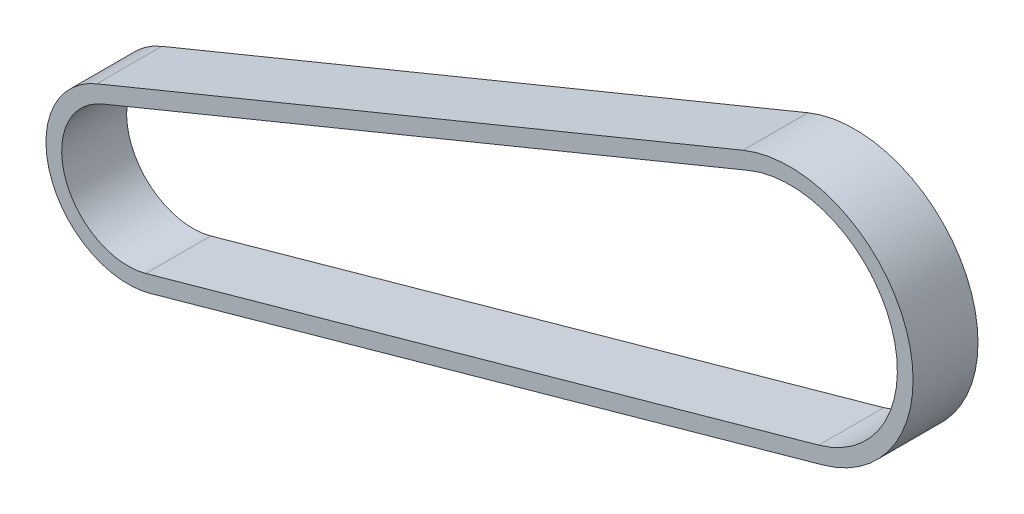
ISO-10303-21;
HEADER;
FILE_DESCRIPTION(('STEP AP214'),'2;1');
FILE_NAME('part.step','',(''),(''),'','','');
FILE_SCHEMA(('AUTOMOTIVE_DESIGN { 1 0 10303 214 1 1 1 1 }'));
ENDSEC;
DATA;
#1=APPLICATION_CONTEXT('core data for automotive mechanical design processes');
#2=APPLICATION_PROTOCOL_DEFINITION('international standard','automotive_design',2000,#1);
#3=PRODUCT_CONTEXT('',#1,'mechanical');
#4=PRODUCT('Part','Part','',(#3));
#5=PRODUCT_RELATED_PRODUCT_CATEGORY('part','',(#4));
#6=PRODUCT_DEFINITION_FORMATION('','',#4);
#7=PRODUCT_DEFINITION_CONTEXT('part definition',#1,'design');
#8=PRODUCT_DEFINITION('design','',#6,#7);
#9=PRODUCT_DEFINITION_SHAPE('','',#8);
#10=(LENGTH_UNIT() NAMED_UNIT(*) SI_UNIT(.MILLI.,.METRE.));
#11=(NAMED_UNIT(*) PLANE_ANGLE_UNIT() SI_UNIT($,.RADIAN.));
#12=(NAMED_UNIT(*) SI_UNIT($,.STERADIAN.) SOLID_ANGLE_UNIT());
#13=UNCERTAINTY_MEASURE_WITH_UNIT(LENGTH_MEASURE(1.E-05),#10,'distance_accuracy_value','');
#14=(GEOMETRIC_REPRESENTATION_CONTEXT(3) GLOBAL_UNCERTAINTY_ASSIGNED_CONTEXT((#13)) GLOBAL_UNIT_ASSIGNED_CONTEXT((#10,
#11,#12)) REPRESENTATION_CONTEXT('',''));
#15=CARTESIAN_POINT('',(0.,0.,0.));
#16=DIRECTION('',(0.,0.,1.));
#17=DIRECTION('',(1.,0.,0.));
#18=AXIS2_PLACEMENT_3D('',#15,#16,#17);
#19=CARTESIAN_POINT('',(-61.149997357062,-21.0166636139358,0.));
#20=DIRECTION('',(0.,0.,-1.));
#21=DIRECTION('',(-1.,0.,0.));
#22=AXIS2_PLACEMENT_3D('',#19,#20,#21);
#23=CYLINDRICAL_SURFACE('',#22,6.12747048469087);
#24=DIRECTION('',(0.,0.,-1.));
#25=VECTOR('',#24,1.);
#26=CARTESIAN_POINT('',(-59.5028541791231,-26.918596677952,-3.));
#27=LINE('',#26,#25);
#28=CARTESIAN_POINT('',(-59.5028541791231,-26.918596677952,3.));
#29=VERTEX_POINT('',#28);
#30=CARTESIAN_POINT('',(-59.5028541791231,-26.918596677952,-3.));
#31=VERTEX_POINT('',#30);
#32=EDGE_CURVE('E203',#29,#31,#27,.T.);
#33=ORIENTED_EDGE('',*,*,#32,.T.);
#34=CARTESIAN_POINT('',(-61.149997357062,-21.0166636139358,-3.));
#35=DIRECTION('',(0.,0.,-1.));
#36=DIRECTION('',(-1.,0.,0.));
#37=AXIS2_PLACEMENT_3D('',#34,#35,#36);
#38=CIRCLE('',#37,6.12747048469087);
#39=CARTESIAN_POINT('',(-63.4791660508711,-15.3491361339374,-3.));
#40=VERTEX_POINT('',#39);
#41=EDGE_CURVE('E180',#31,#40,#38,.T.);
#42=ORIENTED_EDGE('',*,*,#41,.T.);
#43=CARTESIAN_POINT('',(-63.4791660508711,-15.3491361339374,3.));
#44=DIRECTION('',(0.,0.,-1.));
#45=VECTOR('',#44,1.);
#46=LINE('',#43,#45);
#47=CARTESIAN_POINT('',(-63.4791660508711,-15.3491361339374,3.));
#48=VERTEX_POINT('',#47);
#49=EDGE_CURVE('E181',#48,#40,#46,.T.);
#50=ORIENTED_EDGE('',*,*,#49,.F.);
#51=CARTESIAN_POINT('',(-61.149997357062,-21.0166636139358,3.));
#52=DIRECTION('',(0.,0.,-1.));
#53=DIRECTION('',(-1.,0.,0.));
#54=AXIS2_PLACEMENT_3D('',#51,#52,#53);
#55=CIRCLE('',#54,6.12747048469087);
#56=EDGE_CURVE('E44',#29,#48,#55,.T.);
#57=ORIENTED_EDGE('',*,*,#56,.F.);
#58=EDGE_LOOP('',(#33,#42,#50,#57));
#59=FACE_BOUND('',#58,.T.);
#60=ADVANCED_FACE('F35',(#59),#23,.F.);
#61=CARTESIAN_POINT('',(-61.149997357062,-21.0166636139358,0.));
#62=DIRECTION('',(0.,0.,-1.));
#63=DIRECTION('',(-1.,0.,0.));
#64=AXIS2_PLACEMENT_3D('',#61,#62,#63);
#65=CYLINDRICAL_SURFACE('',#64,7.57747048469087);
#66=DIRECTION('',(0.,0.,1.));
#67=VECTOR('',#66,1.);
#68=CARTESIAN_POINT('',(-59.1130754582009,-28.3152256726088,-3.));
#69=LINE('',#68,#67);
#70=CARTESIAN_POINT('',(-59.1130754582009,-28.3152256726088,-3.));
#71=VERTEX_POINT('',#70);
#72=CARTESIAN_POINT('',(-59.1130754582009,-28.3152256726088,3.));
#73=VERTEX_POINT('',#72);
#74=EDGE_CURVE('E111',#71,#73,#69,.T.);
#75=ORIENTED_EDGE('',*,*,#74,.T.);
#76=CARTESIAN_POINT('',(-61.149997357062,-21.0166636139358,3.));
#77=DIRECTION('',(0.,0.,-1.));
#78=DIRECTION('',(-1.,0.,0.));
#79=AXIS2_PLACEMENT_3D('',#76,#77,#78);
#80=CIRCLE('',#79,7.57747048469087);
#81=CARTESIAN_POINT('',(-64.0303387761352,-14.0079767001172,3.));
#82=VERTEX_POINT('',#81);
#83=EDGE_CURVE('E11',#73,#82,#80,.T.);
#84=ORIENTED_EDGE('',*,*,#83,.T.);
#85=CARTESIAN_POINT('',(-64.0303387761354,-14.0079767001173,-3.));
#86=DIRECTION('',(0.,0.,1.));
#87=VECTOR('',#86,1.);
#88=LINE('',#85,#87);
#89=CARTESIAN_POINT('',(-64.0303387761352,-14.0079767001172,-3.));
#90=VERTEX_POINT('',#89);
#91=EDGE_CURVE('E52',#90,#82,#88,.T.);
#92=ORIENTED_EDGE('',*,*,#91,.F.);
#93=CARTESIAN_POINT('',(-61.149997357062,-21.0166636139358,-3.));
#94=DIRECTION('',(0.,0.,-1.));
#95=DIRECTION('',(-1.,0.,0.));
#96=AXIS2_PLACEMENT_3D('',#93,#94,#95);
#97=CIRCLE('',#96,7.57747048469087);
#98=EDGE_CURVE('E173',#71,#90,#97,.T.);
#99=ORIENTED_EDGE('',*,*,#98,.F.);
#100=EDGE_LOOP('',(#75,#84,#92,#99));
#101=FACE_BOUND('',#100,.T.);
#102=ADVANCED_FACE('F164',(#101),#65,.T.);
#103=CARTESIAN_POINT('',(2.67002525040597,-9.56705556516743,-3.));
#104=DIRECTION('',(-0.268812910980865,0.963192410108175,0.));
#105=DIRECTION('',(-0.963192410108175,-0.268812910980865,0.));
#106=AXIS2_PLACEMENT_3D('',#103,#104,#105);
#107=PLANE('',#106);
#108=DIRECTION('',(0.,0.,-1.));
#109=VECTOR('',#108,1.);
#110=CARTESIAN_POINT('',(2.67002525040597,-9.56705556516743,-3.));
#111=LINE('',#110,#109);
#112=CARTESIAN_POINT('',(2.67002525040597,-9.56705556516743,3.));
#113=VERTEX_POINT('',#112);
#114=CARTESIAN_POINT('',(2.67002525040597,-9.56705556516743,-3.));
#115=VERTEX_POINT('',#114);
#116=EDGE_CURVE('E126',#113,#115,#111,.T.);
#117=ORIENTED_EDGE('',*,*,#116,.T.);
#118=DIRECTION('',(-0.963192410108175,-0.268812910980865,0.));
#119=VECTOR('',#118,1.);
#120=CARTESIAN_POINT('',(2.67002525040597,-9.56705556516743,-3.));
#121=LINE('',#120,#119);
#122=EDGE_CURVE('E208',#115,#31,#121,.T.);
#123=ORIENTED_EDGE('',*,*,#122,.T.);
#124=ORIENTED_EDGE('',*,*,#32,.F.);
#125=DIRECTION('',(-0.963192410108175,-0.268812910980865,0.));
#126=VECTOR('',#125,1.);
#127=CARTESIAN_POINT('',(2.67002525040597,-9.56705556516743,3.));
#128=LINE('',#127,#126);
#129=EDGE_CURVE('E329',#113,#29,#128,.T.);
#130=ORIENTED_EDGE('',*,*,#129,.F.);
#131=EDGE_LOOP('',(#117,#123,#124,#130));
#132=FACE_BOUND('',#131,.T.);
#133=ADVANCED_FACE('F161',(#132),#107,.T.);
#134=CARTESIAN_POINT('',(3.0598039713282,-10.9636845598243,-3.));
#135=DIRECTION('',(0.268812910980865,-0.963192410108175,0.));
#136=DIRECTION('',(0.963192410108175,0.268812910980865,0.));
#137=AXIS2_PLACEMENT_3D('',#134,#135,#136);
#138=PLANE('',#137);
#139=DIRECTION('',(0.,0.,1.));
#140=VECTOR('',#139,1.);
#141=CARTESIAN_POINT('',(3.0598039713282,-10.9636845598243,-3.));
#142=LINE('',#141,#140);
#143=CARTESIAN_POINT('',(3.0598039713282,-10.9636845598243,-3.));
#144=VERTEX_POINT('',#143);
#145=CARTESIAN_POINT('',(3.0598039713282,-10.9636845598243,3.));
#146=VERTEX_POINT('',#145);
#147=EDGE_CURVE('E123',#144,#146,#142,.T.);
#148=ORIENTED_EDGE('',*,*,#147,.T.);
#149=DIRECTION('',(-0.963192410108175,-0.268812910980865,0.));
#150=VECTOR('',#149,1.);
#151=CARTESIAN_POINT('',(3.0598039713282,-10.9636845598243,3.));
#152=LINE('',#151,#150);
#153=EDGE_CURVE('E107',#146,#73,#152,.T.);
#154=ORIENTED_EDGE('',*,*,#153,.T.);
#155=ORIENTED_EDGE('',*,*,#74,.F.);
#156=DIRECTION('',(-0.963192410108175,-0.268812910980865,0.));
#157=VECTOR('',#156,1.);
#158=CARTESIAN_POINT('',(3.0598039713282,-10.9636845598243,-3.));
#159=LINE('',#158,#157);
#160=EDGE_CURVE('E325',#144,#71,#159,.T.);
#161=ORIENTED_EDGE('',*,*,#160,.F.);
#162=EDGE_LOOP('',(#148,#154,#155,#161));
#163=FACE_BOUND('',#162,.T.);
#164=ADVANCED_FACE('F157',(#163),#138,.T.);
#165=CARTESIAN_POINT('',(0.,0.,0.));
#166=DIRECTION('',(0.,0.,-1.));
#167=DIRECTION('',(-1.,0.,0.));
#168=AXIS2_PLACEMENT_3D('',#165,#166,#167);
#169=CYLINDRICAL_SURFACE('',#168,9.93265256740647);
#170=DIRECTION('',(0.,0.,-1.));
#171=VECTOR('',#170,1.);
#172=CARTESIAN_POINT('',(-3.77559116184837,9.18708323698978,-3.));
#173=LINE('',#172,#171);
#174=CARTESIAN_POINT('',(-3.77559116184837,9.18708323698978,3.));
#175=VERTEX_POINT('',#174);
#176=CARTESIAN_POINT('',(-3.77559116184837,9.18708323698978,-3.));
#177=VERTEX_POINT('',#176);
#178=EDGE_CURVE('E120',#175,#177,#173,.T.);
#179=ORIENTED_EDGE('',*,*,#178,.T.);
#180=CARTESIAN_POINT('',(0.,0.,-3.));
#181=DIRECTION('',(0.,0.,-1.));
#182=DIRECTION('',(-1.,0.,0.));
#183=AXIS2_PLACEMENT_3D('',#180,#181,#182);
#184=CIRCLE('',#183,9.93265256740647);
#185=EDGE_CURVE('E212',#177,#115,#184,.T.);
#186=ORIENTED_EDGE('',*,*,#185,.T.);
#187=ORIENTED_EDGE('',*,*,#116,.F.);
#188=CARTESIAN_POINT('',(0.,0.,3.));
#189=DIRECTION('',(0.,0.,-1.));
#190=DIRECTION('',(-1.,0.,0.));
#191=AXIS2_PLACEMENT_3D('',#188,#189,#190);
#192=CIRCLE('',#191,9.93265256740647);
#193=EDGE_CURVE('E112',#175,#113,#192,.T.);
#194=ORIENTED_EDGE('',*,*,#193,.F.);
#195=EDGE_LOOP('',(#179,#186,#187,#194));
#196=FACE_BOUND('',#195,.T.);
#197=ADVANCED_FACE('F154',(#196),#169,.F.);
#198=CARTESIAN_POINT('',(0.,0.,0.));
#199=DIRECTION('',(0.,0.,-1.));
#200=DIRECTION('',(-1.,0.,0.));
#201=AXIS2_PLACEMENT_3D('',#198,#199,#200);
#202=CYLINDRICAL_SURFACE('',#201,11.3826525674065);
#203=DIRECTION('',(0.,0.,1.));
#204=VECTOR('',#203,1.);
#205=CARTESIAN_POINT('',(-4.3267638871126,10.5282426708099,-3.));
#206=LINE('',#205,#204);
#207=CARTESIAN_POINT('',(-4.3267638871126,10.5282426708099,-3.));
#208=VERTEX_POINT('',#207);
#209=CARTESIAN_POINT('',(-4.3267638871126,10.5282426708099,3.));
#210=VERTEX_POINT('',#209);
#211=EDGE_CURVE('E115',#208,#210,#206,.T.);
#212=ORIENTED_EDGE('',*,*,#211,.T.);
#213=CARTESIAN_POINT('',(0.,0.,3.));
#214=DIRECTION('',(0.,0.,-1.));
#215=DIRECTION('',(-1.,0.,0.));
#216=AXIS2_PLACEMENT_3D('',#213,#214,#215);
#217=CIRCLE('',#216,11.3826525674065);
#218=EDGE_CURVE('E102',#210,#146,#217,.T.);
#219=ORIENTED_EDGE('',*,*,#218,.T.);
#220=ORIENTED_EDGE('',*,*,#147,.F.);
#221=CARTESIAN_POINT('',(0.,0.,-3.));
#222=DIRECTION('',(0.,0.,-1.));
#223=DIRECTION('',(-1.,0.,0.));
#224=AXIS2_PLACEMENT_3D('',#221,#222,#223);
#225=CIRCLE('',#224,11.3826525674065);
#226=EDGE_CURVE('E118',#208,#144,#225,.T.);
#227=ORIENTED_EDGE('',*,*,#226,.F.);
#228=EDGE_LOOP('',(#212,#219,#220,#227));
#229=FACE_BOUND('',#228,.T.);
#230=ADVANCED_FACE('F116',(#229),#202,.T.);
#231=CARTESIAN_POINT('',(-4.3267638871126,10.5282426708099,-3.));
#232=DIRECTION('',(0.380119120871884,-0.924937540565624,0.));
#233=DIRECTION('',(0.924937540565624,0.380119120871884,0.));
#234=AXIS2_PLACEMENT_3D('',#231,#232,#233);
#235=PLANE('',#234);
#236=ORIENTED_EDGE('',*,*,#91,.T.);
#237=DIRECTION('',(-0.924937540565624,-0.380119120871884,0.));
#238=VECTOR('',#237,1.);
#239=CARTESIAN_POINT('',(-4.3267638871126,10.5282426708099,3.));
#240=LINE('',#239,#238);
#241=EDGE_CURVE('E105',#210,#82,#240,.T.);
#242=ORIENTED_EDGE('',*,*,#241,.F.);
#243=ORIENTED_EDGE('',*,*,#211,.F.);
#244=DIRECTION('',(-0.924937540565624,-0.380119120871884,0.));
#245=VECTOR('',#244,1.);
#246=CARTESIAN_POINT('',(-4.3267638871126,10.5282426708099,-3.));
#247=LINE('',#246,#245);
#248=EDGE_CURVE('E140',#208,#90,#247,.T.);
#249=ORIENTED_EDGE('',*,*,#248,.T.);
#250=EDGE_LOOP('',(#236,#242,#243,#249));
#251=FACE_BOUND('',#250,.T.);
#252=ADVANCED_FACE('F122',(#251),#235,.F.);
#253=CARTESIAN_POINT('',(-4.3267638871126,10.5282426708099,3.));
#254=DIRECTION('',(0.,0.,-1.));
#255=DIRECTION('',(-1.,0.,0.));
#256=AXIS2_PLACEMENT_3D('',#253,#254,#255);
#257=PLANE('',#256);
#258=DIRECTION('',(-0.924937540565624,-0.380119120871884,0.));
#259=VECTOR('',#258,1.);
#260=CARTESIAN_POINT('',(-3.77559116184837,9.18708323698978,3.));
#261=LINE('',#260,#259);
#262=EDGE_CURVE('E124',#175,#48,#261,.T.);
#263=ORIENTED_EDGE('',*,*,#262,.F.);
#264=ORIENTED_EDGE('',*,*,#193,.T.);
#265=ORIENTED_EDGE('',*,*,#129,.T.);
#266=ORIENTED_EDGE('',*,*,#56,.T.);
#267=EDGE_LOOP('',(#263,#264,#265,#266));
#268=FACE_BOUND('',#267,.T.);
#269=ORIENTED_EDGE('',*,*,#241,.T.);
#270=ORIENTED_EDGE('',*,*,#83,.F.);
#271=ORIENTED_EDGE('',*,*,#153,.F.);
#272=ORIENTED_EDGE('',*,*,#218,.F.);
#273=EDGE_LOOP('',(#269,#270,#271,#272));
#274=FACE_BOUND('',#273,.T.);
#275=ADVANCED_FACE('F104',(#268,#274),#257,.F.);
#276=CARTESIAN_POINT('',(-3.77559116184837,9.18708323698978,-3.));
#277=DIRECTION('',(-0.380119120871884,0.924937540565624,0.));
#278=DIRECTION('',(-0.924937540565624,-0.380119120871884,0.));
#279=AXIS2_PLACEMENT_3D('',#276,#277,#278);
#280=PLANE('',#279);
#281=ORIENTED_EDGE('',*,*,#49,.T.);
#282=DIRECTION('',(-0.924937540565624,-0.380119120871884,0.));
#283=VECTOR('',#282,1.);
#284=CARTESIAN_POINT('',(-3.77559116184837,9.18708323698978,-3.));
#285=LINE('',#284,#283);
#286=EDGE_CURVE('E128',#177,#40,#285,.T.);
#287=ORIENTED_EDGE('',*,*,#286,.F.);
#288=ORIENTED_EDGE('',*,*,#178,.F.);
#289=ORIENTED_EDGE('',*,*,#262,.T.);
#290=EDGE_LOOP('',(#281,#287,#288,#289));
#291=FACE_BOUND('',#290,.T.);
#292=ADVANCED_FACE('F221',(#291),#280,.F.);
#293=CARTESIAN_POINT('',(-4.3267638871126,10.5282426708099,-3.));
#294=DIRECTION('',(0.,0.,1.));
#295=DIRECTION('',(1.,0.,0.));
#296=AXIS2_PLACEMENT_3D('',#293,#294,#295);
#297=PLANE('',#296);
#298=ORIENTED_EDGE('',*,*,#248,.F.);
#299=ORIENTED_EDGE('',*,*,#226,.T.);
#300=ORIENTED_EDGE('',*,*,#160,.T.);
#301=ORIENTED_EDGE('',*,*,#98,.T.);
#302=EDGE_LOOP('',(#298,#299,#300,#301));
#303=FACE_BOUND('',#302,.T.);
#304=ORIENTED_EDGE('',*,*,#286,.T.);
#305=ORIENTED_EDGE('',*,*,#41,.F.);
#306=ORIENTED_EDGE('',*,*,#122,.F.);
#307=ORIENTED_EDGE('',*,*,#185,.F.);
#308=EDGE_LOOP('',(#304,#305,#306,#307));
#309=FACE_BOUND('',#308,.T.);
#310=ADVANCED_FACE('F207',(#303,#309),#297,.F.);
#311=CLOSED_SHELL('',(#60,#102,#133,#164,#197,#230,#252,#275,#292,#310));
#312=MANIFOLD_SOLID_BREP('B2',#311);
#313=ADVANCED_BREP_SHAPE_REPRESENTATION('',(#18,#312),#14);
#314=SHAPE_DEFINITION_REPRESENTATION(#9,#313);
ENDSEC;
END-ISO-10303-21;
